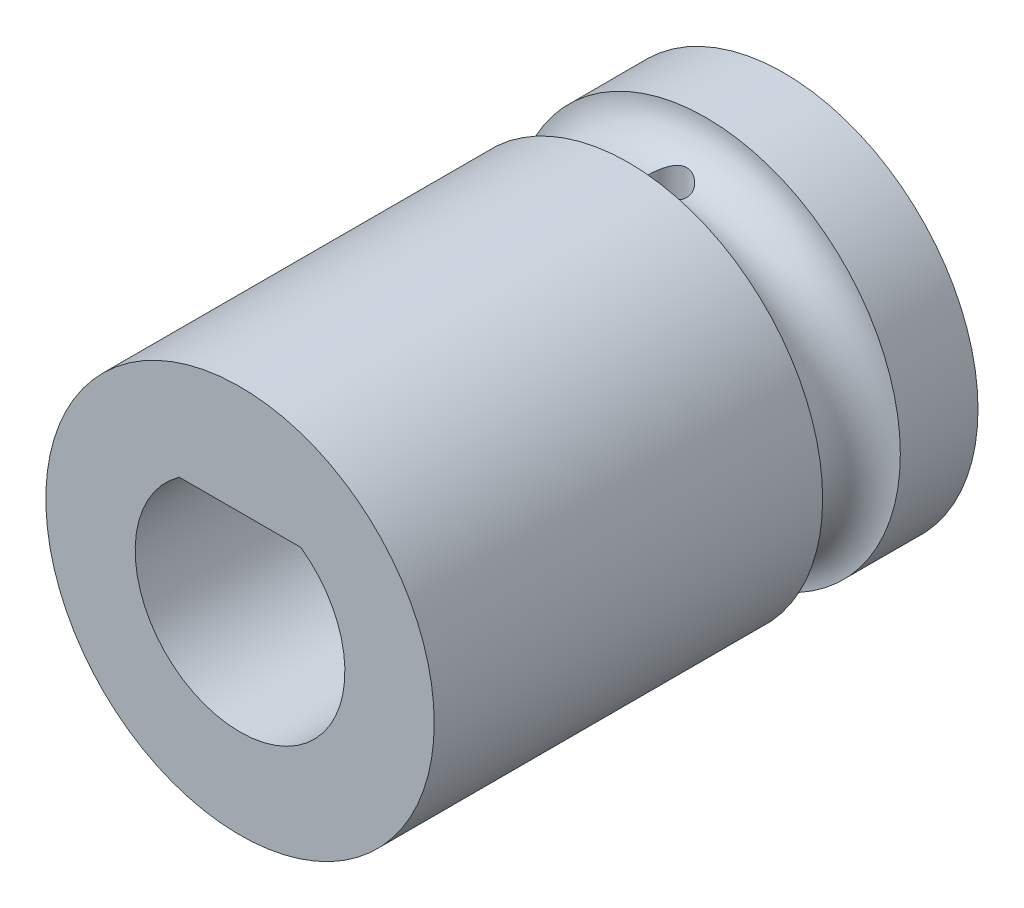
ISO-10303-21;
HEADER;
FILE_DESCRIPTION(('STEP AP214'),'2;1');
FILE_NAME('part.step','',(''),(''),'','','');
FILE_SCHEMA(('AUTOMOTIVE_DESIGN { 1 0 10303 214 1 1 1 1 }'));
ENDSEC;
DATA;
#1=APPLICATION_CONTEXT('core data for automotive mechanical design processes');
#2=APPLICATION_PROTOCOL_DEFINITION('international standard','automotive_design',2000,#1);
#3=PRODUCT_CONTEXT('',#1,'mechanical');
#4=PRODUCT('Part','Part','',(#3));
#5=PRODUCT_RELATED_PRODUCT_CATEGORY('part','',(#4));
#6=PRODUCT_DEFINITION_FORMATION('','',#4);
#7=PRODUCT_DEFINITION_CONTEXT('part definition',#1,'design');
#8=PRODUCT_DEFINITION('design','',#6,#7);
#9=PRODUCT_DEFINITION_SHAPE('','',#8);
#10=(LENGTH_UNIT() NAMED_UNIT(*) SI_UNIT(.MILLI.,.METRE.));
#11=(NAMED_UNIT(*) PLANE_ANGLE_UNIT() SI_UNIT($,.RADIAN.));
#12=(NAMED_UNIT(*) SI_UNIT($,.STERADIAN.) SOLID_ANGLE_UNIT());
#13=UNCERTAINTY_MEASURE_WITH_UNIT(LENGTH_MEASURE(1.E-05),#10,'distance_accuracy_value','');
#14=(GEOMETRIC_REPRESENTATION_CONTEXT(3) GLOBAL_UNCERTAINTY_ASSIGNED_CONTEXT((#13)) GLOBAL_UNIT_ASSIGNED_CONTEXT((#10,
#11,#12)) REPRESENTATION_CONTEXT('',''));
#15=CARTESIAN_POINT('',(0.,0.,0.));
#16=DIRECTION('',(0.,0.,1.));
#17=DIRECTION('',(1.,0.,0.));
#18=AXIS2_PLACEMENT_3D('',#15,#16,#17);
#19=CARTESIAN_POINT('',(0.,0.,0.));
#20=DIRECTION('',(0.,0.,-1.));
#21=DIRECTION('',(-1.,0.,0.));
#22=AXIS2_PLACEMENT_3D('',#19,#20,#21);
#23=TOROIDAL_SURFACE('',#22,5.,1.);
#24=CARTESIAN_POINT('',(0.,0.,-1.));
#25=DIRECTION('',(0.,0.,-1.));
#26=DIRECTION('',(-1.,0.,0.));
#27=AXIS2_PLACEMENT_3D('',#24,#25,#26);
#28=CIRCLE('',#27,5.);
#29=CARTESIAN_POINT('',(-5.,0.,-1.));
#30=VERTEX_POINT('',#29);
#31=EDGE_CURVE('E87',#30,#30,#28,.T.);
#32=ORIENTED_EDGE('',*,*,#31,.F.);
#33=EDGE_LOOP('',(#32));
#34=FACE_BOUND('',#33,.T.);
#35=CARTESIAN_POINT('',(0.,0.,1.));
#36=DIRECTION('',(0.,0.,-1.));
#37=DIRECTION('',(-1.,0.,0.));
#38=AXIS2_PLACEMENT_3D('',#35,#36,#37);
#39=CIRCLE('',#38,5.);
#40=CARTESIAN_POINT('',(-5.,0.,1.));
#41=VERTEX_POINT('',#40);
#42=EDGE_CURVE('E90',#41,#41,#39,.T.);
#43=ORIENTED_EDGE('',*,*,#42,.T.);
#44=EDGE_LOOP('',(#43));
#45=FACE_BOUND('',#44,.T.);
#46=CARTESIAN_POINT('',(-0.372468408296793,4.04014082139855,-0.333567511638729));
#47=CARTESIAN_POINT('',(-0.390230555620168,4.03145590678815,-0.313733354209234));
#48=CARTESIAN_POINT('',(-0.406462777481591,4.02296904309552,-0.292422498371599));
#49=CARTESIAN_POINT('',(-0.435493914762934,4.00716402772466,-0.247122614799132));
#50=CARTESIAN_POINT('',(-0.448287327413241,3.99984775670653,-0.223129380567832));
#51=CARTESIAN_POINT('',(-0.470003036773287,3.98711323500895,-0.172778211812347));
#52=CARTESIAN_POINT('',(-0.478902021141419,3.98170645085645,-0.146407146572026));
#53=CARTESIAN_POINT('',(-0.492218343007203,3.9735211454164,-0.0921829731054653));
#54=CARTESIAN_POINT('',(-0.496642371919204,3.97073870036887,-0.0643321434123838));
#55=CARTESIAN_POINT('',(-0.500513727624202,3.96830465546469,-0.011087873739299));
#56=CARTESIAN_POINT('',(-0.500432441468356,3.96835649806029,0.0142585296626455));
#57=CARTESIAN_POINT('',(-0.496458864278098,3.97085320334425,0.0645305845795796));
#58=CARTESIAN_POINT('',(-0.492566328205519,3.97329821989785,0.0894562089364419));
#59=CARTESIAN_POINT('',(-0.481466013837055,3.98013701436923,0.136955781033447));
#60=CARTESIAN_POINT('',(-0.474429103567044,3.98442997996138,0.159585135723396));
#61=CARTESIAN_POINT('',(-0.457394207956114,3.9945447924013,0.203327135060068));
#62=CARTESIAN_POINT('',(-0.447395630747366,4.00036694481969,0.224439475493498));
#63=CARTESIAN_POINT('',(-0.423568210688116,4.01373944800617,0.266913503973723));
#64=CARTESIAN_POINT('',(-0.409450476680945,4.02140616982585,0.288075852169816));
#65=CARTESIAN_POINT('',(-0.378321439677714,4.03739848064414,0.327891200166169));
#66=CARTESIAN_POINT('',(-0.361307144763664,4.04572474609551,0.346541569248391));
#67=CARTESIAN_POINT('',(-0.322065638392313,4.0635463980187,0.383536799648171));
#68=CARTESIAN_POINT('',(-0.299441375238702,4.07304023757558,0.401463754711107));
#69=CARTESIAN_POINT('',(-0.251148989445207,4.09095762472485,0.433311815306786));
#70=CARTESIAN_POINT('',(-0.225483012948028,4.09938191836638,0.447235721786929));
#71=CARTESIAN_POINT('',(-0.176444845603572,4.11272229324894,0.468450964712971));
#72=CARTESIAN_POINT('',(-0.153492948988129,4.11799701445744,0.476485400836898));
#73=CARTESIAN_POINT('',(-0.106314972928426,4.1264823112949,0.489174915725389));
#74=CARTESIAN_POINT('',(-0.0820904204318754,4.12969530206936,0.493833949321849));
#75=CARTESIAN_POINT('',(-0.032900639111239,4.13364089455719,0.499532581170884));
#76=CARTESIAN_POINT('',(-0.00793260849252265,4.13436246414868,0.500556081697156));
#77=CARTESIAN_POINT('',(0.0418172662384302,4.13318587381181,0.498869668424676));
#78=CARTESIAN_POINT('',(0.0665990737980821,4.13128721241657,0.496159039978413));
#79=CARTESIAN_POINT('',(0.113563955533142,4.12535259491182,0.48747903200823));
#80=CARTESIAN_POINT('',(0.1358100811676,4.12146775306397,0.481739236704858));
#81=CARTESIAN_POINT('',(0.17900117442679,4.11208819227461,0.467415057226174));
#82=CARTESIAN_POINT('',(0.199945707747279,4.10659293944367,0.458829729565566));
#83=CARTESIAN_POINT('',(0.24245916523956,4.09382545815668,0.437989167641779));
#84=CARTESIAN_POINT('',(0.263840970377849,4.08642391952654,0.425433071311141));
#85=CARTESIAN_POINT('',(0.304368621325262,4.07093846289235,0.397450797254383));
#86=CARTESIAN_POINT('',(0.32351267626181,4.0628540071423,0.382022346036756));
#87=CARTESIAN_POINT('',(0.362303495972935,4.04531009019026,0.345763714142166));
#88=CARTESIAN_POINT('',(0.381510115536208,4.03584427423295,0.324462188272361));
#89=CARTESIAN_POINT('',(0.416165953936207,4.01784418049629,0.278623948231329));
#90=CARTESIAN_POINT('',(0.431613961190525,4.00931020358105,0.254086194787667));
#91=CARTESIAN_POINT('',(0.458299331798142,3.99407423274108,0.202043563104441));
#92=CARTESIAN_POINT('',(0.469507669249616,3.9873849495602,0.174519834314303));
#93=CARTESIAN_POINT('',(0.486923844635509,3.97681550122383,0.117436962677478));
#94=CARTESIAN_POINT('',(0.493140113411334,3.97293060102089,0.0878813434420186));
#95=CARTESIAN_POINT('',(0.499625962351826,3.96886673686593,0.0322619280273679));
#96=CARTESIAN_POINT('',(0.500628957211589,3.96823094574248,0.00631548938579053));
#97=CARTESIAN_POINT('',(0.498608710814696,3.96950306026729,-0.045354995918277));
#98=CARTESIAN_POINT('',(0.495586242830334,3.9714104773774,-0.0710790843378865));
#99=CARTESIAN_POINT('',(0.486068601470352,3.97731173518727,-0.119596611754359));
#100=CARTESIAN_POINT('',(0.479848201744424,3.98113998477369,-0.142465773382201));
#101=CARTESIAN_POINT('',(0.464388475948766,3.99042255529145,-0.186801741906362));
#102=CARTESIAN_POINT('',(0.455148614960446,3.99587716432869,-0.208268299512452));
#103=CARTESIAN_POINT('',(0.433017173687219,4.00850450992938,-0.251259440033293));
#104=CARTESIAN_POINT('',(0.419875648078762,4.01578625642259,-0.272622621030648));
#105=CARTESIAN_POINT('',(0.390720252739499,4.03114408328441,-0.312983293459092));
#106=CARTESIAN_POINT('',(0.37470374172601,4.03922089097738,-0.331978582057006));
#107=CARTESIAN_POINT('',(0.337545259735711,4.056732721776,-0.369957689642616));
#108=CARTESIAN_POINT('',(0.315996241361644,4.0661935667618,-0.388533197375611));
#109=CARTESIAN_POINT('',(0.2698431688064,4.08433513190538,-0.421893965346994));
#110=CARTESIAN_POINT('',(0.245240180465808,4.09301612242062,-0.436680542438469));
#111=CARTESIAN_POINT('',(0.197304722065759,4.10736342999119,-0.460076455668075));
#112=CARTESIAN_POINT('',(0.174341366451172,4.11328702683412,-0.469281403658083));
#113=CARTESIAN_POINT('',(0.126921936855224,4.12314955343845,-0.484259589256328));
#114=CARTESIAN_POINT('',(0.102467579754288,4.12709071931391,-0.490036694680858));
#115=CARTESIAN_POINT('',(0.0525459037838662,4.13248118378078,-0.497875665698879));
#116=CARTESIAN_POINT('',(0.0270737000007769,4.13391647556686,-0.499916650972771));
#117=CARTESIAN_POINT('',(-0.0238877990581899,4.1340291730579,-0.50007827408194));
#118=CARTESIAN_POINT('',(-0.0493770910021345,4.13270701398915,-0.498199530593319));
#119=CARTESIAN_POINT('',(-0.0972816085424096,4.12774395270413,-0.490990039380794));
#120=CARTESIAN_POINT('',(-0.119769433680886,4.12431828873591,-0.485979025514207));
#121=CARTESIAN_POINT('',(-0.163551854029236,4.11574230559612,-0.473046025632257));
#122=CARTESIAN_POINT('',(-0.18484549443536,4.11059062871897,-0.465121747524084));
#123=CARTESIAN_POINT('',(-0.227750702909191,4.09853286207545,-0.445794625294777));
#124=CARTESIAN_POINT('',(-0.249215545611659,4.09150993731205,-0.434141240204654));
#125=CARTESIAN_POINT('',(-0.290006763529923,4.07666562870491,-0.408022224719351));
#126=CARTESIAN_POINT('',(-0.309335501944471,4.06884514601337,-0.39355975192331));
#127=CARTESIAN_POINT('',(-0.34340371499092,4.0540078758011,-0.364028812594966));
#128=CARTESIAN_POINT('',(-0.358414930883727,4.04701235832984,-0.349260371199452));
#129=CARTESIAN_POINT('',(-0.372468408296793,4.04014082139855,-0.333567511638729));
#130=B_SPLINE_CURVE_WITH_KNOTS('',3,(#46,#47,#48,#49,#50,#51,#52,#53,#54,#55,#56,#57,#58,#59,
#60,#61,#62,#63,#64,#65,#66,#67,#68,#69,#70,#71,#72,#73,#74,#75,#76,#77,#78,#79,#80,#81,#82,#83,
#84,#85,#86,#87,#88,#89,#90,#91,#92,#93,#94,#95,#96,#97,#98,#99,#100,#101,#102,#103,#104,#105,
#106,#107,#108,#109,#110,#111,#112,#113,#114,#115,#116,#117,#118,#119,#120,#121,#122,#123,#124,
#125,#126,#127,#128,#129),.UNSPECIFIED.,.T.,.F.,(4,2,2,2,2,2,2,2,2,2,2,2,2,2,2,2,2,2,2,2,2,2,2,
2,2,2,2,2,2,2,2,2,2,2,2,2,2,2,2,2,2,4),(0.,0.0839523653114785,0.168038281750354,
0.252620878304907,0.337076810442998,0.412714742373884,0.488357537642985,0.560312764818019,
0.63228238144019,0.71168313354275,0.791166403546224,0.881914401725628,0.972598747801953,
1.04693906617027,1.12119214130211,1.19577359355435,1.27036932138595,1.33998608907031,
1.40962596252392,1.4869675818969,1.56437068005738,1.65457049320832,1.74479934371124,
1.83563520124334,1.92631732635542,2.00381021034472,2.08128821046588,2.15300828866807,
2.22474107947579,2.30279158160955,2.38091416011171,2.47046696928302,2.55998861178828,
2.63599263207598,2.71191072910777,2.78825183455331,2.86458089150078,2.93416457515449,
3.00380312330835,3.07976553439166,3.1556430477871,3.22206647329972),.UNSPECIFIED.);
#131=CARTESIAN_POINT('',(-0.372468408296793,4.04014082139855,-0.333567511638729));
#132=VERTEX_POINT('',#131);
#133=EDGE_CURVE('E83',#132,#132,#130,.T.);
#134=ORIENTED_EDGE('',*,*,#133,.F.);
#135=EDGE_LOOP('',(#134));
#136=FACE_BOUND('',#135,.T.);
#137=ADVANCED_FACE('F34',(#34,#45,#136),#23,.F.);
#138=CARTESIAN_POINT('',(0.,0.,-3.));
#139=DIRECTION('',(0.,0.,1.));
#140=DIRECTION('',(1.,0.,0.));
#141=AXIS2_PLACEMENT_3D('',#138,#139,#140);
#142=CYLINDRICAL_SURFACE('',#141,5.);
#143=ORIENTED_EDGE('',*,*,#31,.T.);
#144=EDGE_LOOP('',(#143));
#145=FACE_BOUND('',#144,.T.);
#146=CARTESIAN_POINT('',(0.,0.,-3.));
#147=DIRECTION('',(0.,0.,1.));
#148=DIRECTION('',(1.,0.,0.));
#149=AXIS2_PLACEMENT_3D('',#146,#147,#148);
#150=CIRCLE('',#149,5.);
#151=CARTESIAN_POINT('',(5.,0.,-3.));
#152=VERTEX_POINT('',#151);
#153=EDGE_CURVE('E42',#152,#152,#150,.T.);
#154=ORIENTED_EDGE('',*,*,#153,.T.);
#155=EDGE_LOOP('',(#154));
#156=FACE_BOUND('',#155,.T.);
#157=ADVANCED_FACE('F131',(#145,#156),#142,.T.);
#158=ORIENTED_EDGE('',*,*,#42,.F.);
#159=EDGE_LOOP('',(#158));
#160=FACE_BOUND('',#159,.T.);
#161=CARTESIAN_POINT('',(0.,0.,11.));
#162=DIRECTION('',(0.,0.,1.));
#163=DIRECTION('',(1.,0.,0.));
#164=AXIS2_PLACEMENT_3D('',#161,#162,#163);
#165=CIRCLE('',#164,5.);
#166=CARTESIAN_POINT('',(5.,0.,11.));
#167=VERTEX_POINT('',#166);
#168=EDGE_CURVE('E103',#167,#167,#165,.T.);
#169=ORIENTED_EDGE('',*,*,#168,.F.);
#170=EDGE_LOOP('',(#169));
#171=FACE_BOUND('',#170,.T.);
#172=ADVANCED_FACE('F36',(#160,#171),#142,.T.);
#173=CARTESIAN_POINT('',(0.,0.,-3.));
#174=DIRECTION('',(0.,0.,1.));
#175=DIRECTION('',(1.,0.,0.));
#176=AXIS2_PLACEMENT_3D('',#173,#174,#175);
#177=PLANE('',#176);
#178=DIRECTION('',(-1.,0.,0.));
#179=VECTOR('',#178,1.);
#180=CARTESIAN_POINT('',(1.56524758424985,2.2,-3.));
#181=LINE('',#180,#179);
#182=CARTESIAN_POINT('',(1.56524758424985,2.2,-3.));
#183=VERTEX_POINT('',#182);
#184=CARTESIAN_POINT('',(0.5,2.2,-3.));
#185=VERTEX_POINT('',#184);
#186=EDGE_CURVE('E108',#183,#185,#181,.T.);
#187=ORIENTED_EDGE('',*,*,#186,.T.);
#188=CARTESIAN_POINT('',(0.,2.2,-3.));
#189=DIRECTION('',(0.,0.,-1.));
#190=DIRECTION('',(-1.,0.,0.));
#191=AXIS2_PLACEMENT_3D('',#188,#189,#190);
#192=CIRCLE('',#191,0.5);
#193=CARTESIAN_POINT('',(-0.5,2.2,-3.));
#194=VERTEX_POINT('',#193);
#195=EDGE_CURVE('E156',#194,#185,#192,.T.);
#196=ORIENTED_EDGE('',*,*,#195,.F.);
#197=CARTESIAN_POINT('',(-1.56524758424985,2.2,-3.));
#198=VERTEX_POINT('',#197);
#199=EDGE_CURVE('E56',#194,#198,#181,.T.);
#200=ORIENTED_EDGE('',*,*,#199,.T.);
#201=CARTESIAN_POINT('',(0.,0.,-3.));
#202=DIRECTION('',(0.,0.,1.));
#203=DIRECTION('',(1.,0.,0.));
#204=AXIS2_PLACEMENT_3D('',#201,#202,#203);
#205=CIRCLE('',#204,2.7);
#206=EDGE_CURVE('E106',#198,#183,#205,.T.);
#207=ORIENTED_EDGE('',*,*,#206,.T.);
#208=EDGE_LOOP('',(#187,#196,#200,#207));
#209=FACE_BOUND('',#208,.T.);
#210=ORIENTED_EDGE('',*,*,#153,.F.);
#211=EDGE_LOOP('',(#210));
#212=FACE_BOUND('',#211,.T.);
#213=ADVANCED_FACE('F145',(#209,#212),#177,.F.);
#214=CARTESIAN_POINT('',(0.,0.,-3.));
#215=DIRECTION('',(0.,0.,1.));
#216=DIRECTION('',(1.,0.,0.));
#217=AXIS2_PLACEMENT_3D('',#214,#215,#216);
#218=CYLINDRICAL_SURFACE('',#217,2.7);
#219=DIRECTION('',(0.,0.,1.));
#220=VECTOR('',#219,1.);
#221=CARTESIAN_POINT('',(-1.56524758424985,2.2,-3.));
#222=LINE('',#221,#220);
#223=CARTESIAN_POINT('',(-1.56524758424985,2.2,11.));
#224=VERTEX_POINT('',#223);
#225=EDGE_CURVE('E112',#198,#224,#222,.T.);
#226=ORIENTED_EDGE('',*,*,#225,.T.);
#227=CARTESIAN_POINT('',(0.,0.,11.));
#228=DIRECTION('',(0.,0.,1.));
#229=DIRECTION('',(1.,0.,0.));
#230=AXIS2_PLACEMENT_3D('',#227,#228,#229);
#231=CIRCLE('',#230,2.7);
#232=CARTESIAN_POINT('',(1.56524758424985,2.2,11.));
#233=VERTEX_POINT('',#232);
#234=EDGE_CURVE('E97',#224,#233,#231,.T.);
#235=ORIENTED_EDGE('',*,*,#234,.T.);
#236=DIRECTION('',(0.,0.,1.));
#237=VECTOR('',#236,1.);
#238=CARTESIAN_POINT('',(1.56524758424985,2.2,-3.));
#239=LINE('',#238,#237);
#240=EDGE_CURVE('E111',#183,#233,#239,.T.);
#241=ORIENTED_EDGE('',*,*,#240,.F.);
#242=ORIENTED_EDGE('',*,*,#206,.F.);
#243=EDGE_LOOP('',(#226,#235,#241,#242));
#244=FACE_BOUND('',#243,.T.);
#245=ADVANCED_FACE('F154',(#244),#218,.F.);
#246=CARTESIAN_POINT('',(1.56524758424985,2.2,-3.));
#247=DIRECTION('',(0.,1.,0.));
#248=DIRECTION('',(0.,0.,1.));
#249=AXIS2_PLACEMENT_3D('',#246,#247,#248);
#250=PLANE('',#249);
#251=CARTESIAN_POINT('',(0.,2.2,0.));
#252=DIRECTION('',(0.,1.,0.));
#253=DIRECTION('',(0.,0.,1.));
#254=AXIS2_PLACEMENT_3D('',#251,#252,#253);
#255=CIRCLE('',#254,0.5);
#256=CARTESIAN_POINT('',(0.5,2.2,0.));
#257=VERTEX_POINT('',#256);
#258=CARTESIAN_POINT('',(-0.5,2.2,0.));
#259=VERTEX_POINT('',#258);
#260=EDGE_CURVE('E81',#257,#259,#255,.F.);
#261=ORIENTED_EDGE('',*,*,#260,.F.);
#262=DIRECTION('',(0.,0.,-1.));
#263=VECTOR('',#262,1.);
#264=CARTESIAN_POINT('',(0.5,2.2,0.));
#265=LINE('',#264,#263);
#266=EDGE_CURVE('E48',#257,#185,#265,.T.);
#267=ORIENTED_EDGE('',*,*,#266,.T.);
#268=ORIENTED_EDGE('',*,*,#186,.F.);
#269=ORIENTED_EDGE('',*,*,#240,.T.);
#270=DIRECTION('',(-1.,0.,0.));
#271=VECTOR('',#270,1.);
#272=CARTESIAN_POINT('',(1.56524758424985,2.2,11.));
#273=LINE('',#272,#271);
#274=EDGE_CURVE('E100',#233,#224,#273,.T.);
#275=ORIENTED_EDGE('',*,*,#274,.T.);
#276=ORIENTED_EDGE('',*,*,#225,.F.);
#277=ORIENTED_EDGE('',*,*,#199,.F.);
#278=DIRECTION('',(0.,0.,-1.));
#279=VECTOR('',#278,1.);
#280=CARTESIAN_POINT('',(-0.5,2.2,0.));
#281=LINE('',#280,#279);
#282=EDGE_CURVE('E75',#259,#194,#281,.T.);
#283=ORIENTED_EDGE('',*,*,#282,.F.);
#284=EDGE_LOOP('',(#261,#267,#268,#269,#275,#276,#277,#283));
#285=FACE_BOUND('',#284,.T.);
#286=ADVANCED_FACE('F80',(#285),#250,.F.);
#287=CARTESIAN_POINT('',(0.,0.,11.));
#288=DIRECTION('',(0.,0.,1.));
#289=DIRECTION('',(1.,0.,0.));
#290=AXIS2_PLACEMENT_3D('',#287,#288,#289);
#291=PLANE('',#290);
#292=ORIENTED_EDGE('',*,*,#168,.T.);
#293=EDGE_LOOP('',(#292));
#294=FACE_BOUND('',#293,.T.);
#295=ORIENTED_EDGE('',*,*,#274,.F.);
#296=ORIENTED_EDGE('',*,*,#234,.F.);
#297=EDGE_LOOP('',(#295,#296));
#298=FACE_BOUND('',#297,.T.);
#299=ADVANCED_FACE('F126',(#294,#298),#291,.T.);
#300=CARTESIAN_POINT('',(0.,11.,0.));
#301=DIRECTION('',(0.,-1.,0.));
#302=DIRECTION('',(0.,0.,-1.));
#303=AXIS2_PLACEMENT_3D('',#300,#301,#302);
#304=CYLINDRICAL_SURFACE('',#303,0.5);
#305=CARTESIAN_POINT('',(0.,2.2,0.));
#306=DIRECTION('',(0.,-0.707106781186547,-0.707106781186547));
#307=DIRECTION('',(0.,-0.707106781186547,0.707106781186547));
#308=AXIS2_PLACEMENT_3D('',#305,#306,#307);
#309=ELLIPSE('',#308,0.707106781186547,0.5);
#310=EDGE_CURVE('E11',#257,#259,#309,.F.);
#311=ORIENTED_EDGE('',*,*,#310,.F.);
#312=ORIENTED_EDGE('',*,*,#260,.T.);
#313=EDGE_LOOP('',(#311,#312));
#314=FACE_BOUND('',#313,.T.);
#315=ORIENTED_EDGE('',*,*,#133,.T.);
#316=EDGE_LOOP('',(#315));
#317=FACE_BOUND('',#316,.T.);
#318=ADVANCED_FACE('F85',(#314,#317),#304,.F.);
#319=CARTESIAN_POINT('',(0.,2.2,0.));
#320=DIRECTION('',(0.,0.,-1.));
#321=DIRECTION('',(-1.,0.,0.));
#322=AXIS2_PLACEMENT_3D('',#319,#320,#321);
#323=CYLINDRICAL_SURFACE('',#322,0.5);
#324=ORIENTED_EDGE('',*,*,#310,.T.);
#325=ORIENTED_EDGE('',*,*,#282,.T.);
#326=ORIENTED_EDGE('',*,*,#195,.T.);
#327=ORIENTED_EDGE('',*,*,#266,.F.);
#328=EDGE_LOOP('',(#324,#325,#326,#327));
#329=FACE_BOUND('',#328,.T.);
#330=ADVANCED_FACE('F74',(#329),#323,.F.);
#331=CLOSED_SHELL('',(#137,#157,#172,#213,#245,#286,#299,#318,#330));
#332=MANIFOLD_SOLID_BREP('B2',#331);
#333=ADVANCED_BREP_SHAPE_REPRESENTATION('',(#18,#332),#14);
#334=SHAPE_DEFINITION_REPRESENTATION(#9,#333);
ENDSEC;
END-ISO-10303-21;
